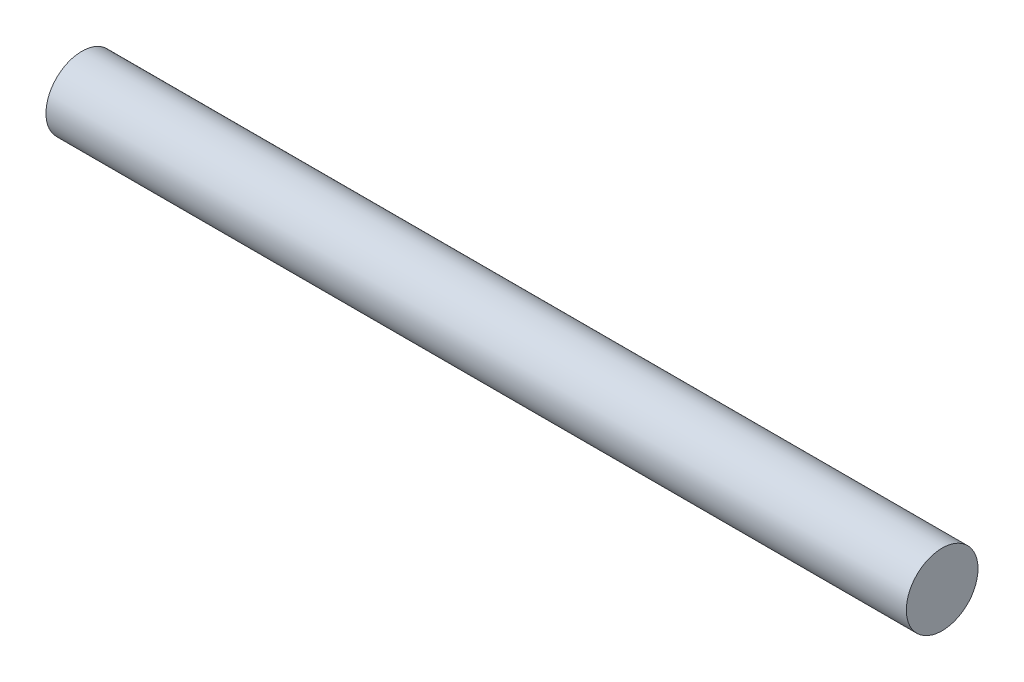
ISO-10303-21;
HEADER;
FILE_DESCRIPTION(('STEP AP214'),'2;1');
FILE_NAME('part.step','',(''),(''),'','','');
FILE_SCHEMA(('AUTOMOTIVE_DESIGN { 1 0 10303 214 1 1 1 1 }'));
ENDSEC;
DATA;
#1=APPLICATION_CONTEXT('core data for automotive mechanical design processes');
#2=APPLICATION_PROTOCOL_DEFINITION('international standard','automotive_design',2000,#1);
#3=PRODUCT_CONTEXT('',#1,'mechanical');
#4=PRODUCT('Part','Part','',(#3));
#5=PRODUCT_RELATED_PRODUCT_CATEGORY('part','',(#4));
#6=PRODUCT_DEFINITION_FORMATION('','',#4);
#7=PRODUCT_DEFINITION_CONTEXT('part definition',#1,'design');
#8=PRODUCT_DEFINITION('design','',#6,#7);
#9=PRODUCT_DEFINITION_SHAPE('','',#8);
#10=(LENGTH_UNIT() NAMED_UNIT(*) SI_UNIT(.MILLI.,.METRE.));
#11=(NAMED_UNIT(*) PLANE_ANGLE_UNIT() SI_UNIT($,.RADIAN.));
#12=(NAMED_UNIT(*) SI_UNIT($,.STERADIAN.) SOLID_ANGLE_UNIT());
#13=UNCERTAINTY_MEASURE_WITH_UNIT(LENGTH_MEASURE(1.E-05),#10,'distance_accuracy_value','');
#14=(GEOMETRIC_REPRESENTATION_CONTEXT(3) GLOBAL_UNCERTAINTY_ASSIGNED_CONTEXT((#13)) GLOBAL_UNIT_ASSIGNED_CONTEXT((#10,
#11,#12)) REPRESENTATION_CONTEXT('',''));
#15=CARTESIAN_POINT('',(0.,0.,0.));
#16=DIRECTION('',(0.,0.,1.));
#17=DIRECTION('',(1.,0.,0.));
#18=AXIS2_PLACEMENT_3D('',#15,#16,#17);
#19=CARTESIAN_POINT('',(30.,0.,0.));
#20=DIRECTION('',(-1.,0.,0.));
#21=DIRECTION('',(0.,0.,1.));
#22=AXIS2_PLACEMENT_3D('',#19,#20,#21);
#23=CYLINDRICAL_SURFACE('',#22,2.5);
#24=CARTESIAN_POINT('',(30.,0.,0.));
#25=DIRECTION('',(1.,0.,0.));
#26=DIRECTION('',(0.,0.,-1.));
#27=AXIS2_PLACEMENT_3D('',#24,#25,#26);
#28=CIRCLE('',#27,2.5);
#29=CARTESIAN_POINT('',(30.,0.,-2.5));
#30=VERTEX_POINT('',#29);
#31=EDGE_CURVE('E10',#30,#30,#28,.T.);
#32=ORIENTED_EDGE('',*,*,#31,.F.);
#33=EDGE_LOOP('',(#32));
#34=FACE_BOUND('',#33,.T.);
#35=CARTESIAN_POINT('',(-30.,0.,0.));
#36=DIRECTION('',(1.,0.,0.));
#37=DIRECTION('',(0.,0.,-1.));
#38=AXIS2_PLACEMENT_3D('',#35,#36,#37);
#39=CIRCLE('',#38,2.5);
#40=CARTESIAN_POINT('',(-30.,0.,-2.5));
#41=VERTEX_POINT('',#40);
#42=EDGE_CURVE('E33',#41,#41,#39,.T.);
#43=ORIENTED_EDGE('',*,*,#42,.T.);
#44=EDGE_LOOP('',(#43));
#45=FACE_BOUND('',#44,.T.);
#46=ADVANCED_FACE('F30',(#34,#45),#23,.T.);
#47=CARTESIAN_POINT('',(30.,0.,0.));
#48=DIRECTION('',(1.,0.,0.));
#49=DIRECTION('',(0.,0.,-1.));
#50=AXIS2_PLACEMENT_3D('',#47,#48,#49);
#51=PLANE('',#50);
#52=ORIENTED_EDGE('',*,*,#31,.T.);
#53=EDGE_LOOP('',(#52));
#54=FACE_BOUND('',#53,.T.);
#55=ADVANCED_FACE('F45',(#54),#51,.T.);
#56=CARTESIAN_POINT('',(-30.,0.,0.));
#57=DIRECTION('',(1.,0.,0.));
#58=DIRECTION('',(0.,0.,-1.));
#59=AXIS2_PLACEMENT_3D('',#56,#57,#58);
#60=PLANE('',#59);
#61=ORIENTED_EDGE('',*,*,#42,.F.);
#62=EDGE_LOOP('',(#61));
#63=FACE_BOUND('',#62,.T.);
#64=ADVANCED_FACE('F43',(#63),#60,.F.);
#65=CLOSED_SHELL('',(#46,#55,#64));
#66=MANIFOLD_SOLID_BREP('B2',#65);
#67=ADVANCED_BREP_SHAPE_REPRESENTATION('',(#18,#66),#14);
#68=SHAPE_DEFINITION_REPRESENTATION(#9,#67);
ENDSEC;
END-ISO-10303-21;
